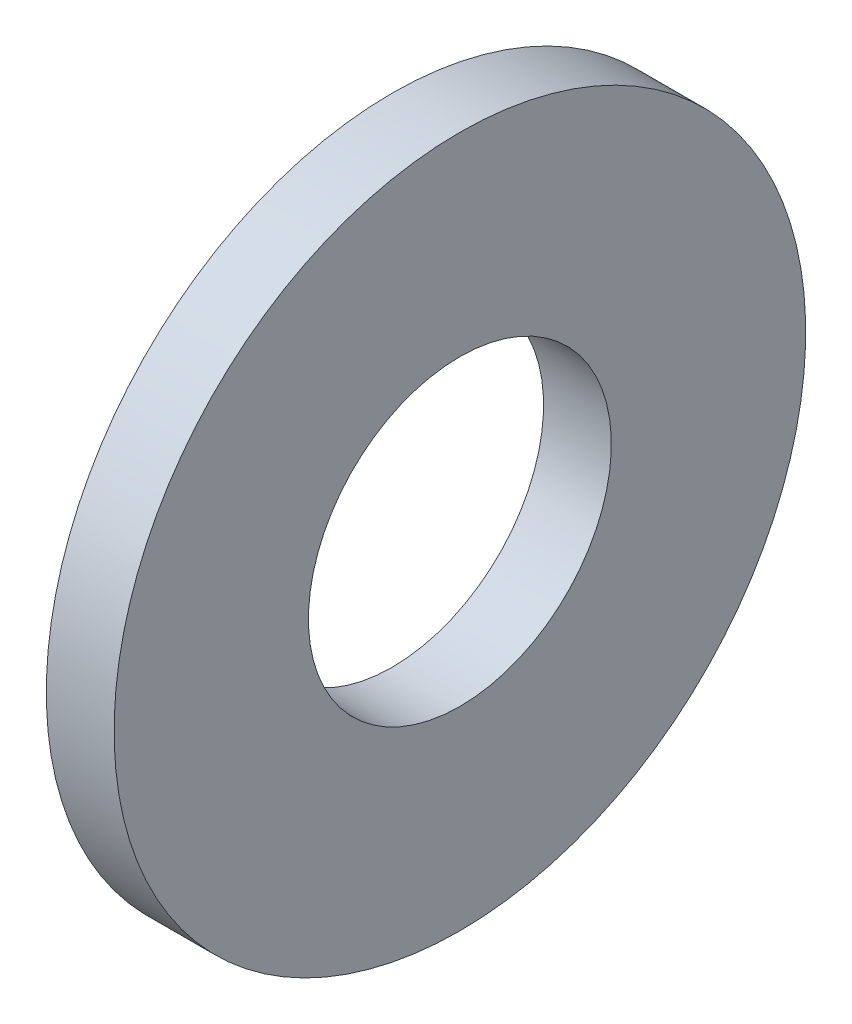
ISO-10303-21;
HEADER;
FILE_DESCRIPTION(('STEP AP214'),'2;1');
FILE_NAME('part.step','',(''),(''),'','','');
FILE_SCHEMA(('AUTOMOTIVE_DESIGN { 1 0 10303 214 1 1 1 1 }'));
ENDSEC;
DATA;
#1=APPLICATION_CONTEXT('core data for automotive mechanical design processes');
#2=APPLICATION_PROTOCOL_DEFINITION('international standard','automotive_design',2000,#1);
#3=PRODUCT_CONTEXT('',#1,'mechanical');
#4=PRODUCT('Part','Part','',(#3));
#5=PRODUCT_RELATED_PRODUCT_CATEGORY('part','',(#4));
#6=PRODUCT_DEFINITION_FORMATION('','',#4);
#7=PRODUCT_DEFINITION_CONTEXT('part definition',#1,'design');
#8=PRODUCT_DEFINITION('design','',#6,#7);
#9=PRODUCT_DEFINITION_SHAPE('','',#8);
#10=(LENGTH_UNIT() NAMED_UNIT(*) SI_UNIT(.MILLI.,.METRE.));
#11=(NAMED_UNIT(*) PLANE_ANGLE_UNIT() SI_UNIT($,.RADIAN.));
#12=(NAMED_UNIT(*) SI_UNIT($,.STERADIAN.) SOLID_ANGLE_UNIT());
#13=UNCERTAINTY_MEASURE_WITH_UNIT(LENGTH_MEASURE(1.E-05),#10,'distance_accuracy_value','');
#14=(GEOMETRIC_REPRESENTATION_CONTEXT(3) GLOBAL_UNCERTAINTY_ASSIGNED_CONTEXT((#13)) GLOBAL_UNIT_ASSIGNED_CONTEXT((#10,
#11,#12)) REPRESENTATION_CONTEXT('',''));
#15=CARTESIAN_POINT('',(0.,0.,0.));
#16=DIRECTION('',(0.,0.,1.));
#17=DIRECTION('',(1.,0.,0.));
#18=AXIS2_PLACEMENT_3D('',#15,#16,#17);
#19=CARTESIAN_POINT('',(0.,2.78129999999999,0.));
#20=DIRECTION('',(-1.,0.,0.));
#21=DIRECTION('',(0.,-1.,0.));
#22=AXIS2_PLACEMENT_3D('',#19,#20,#21);
#23=PLANE('',#22);
#24=CARTESIAN_POINT('',(0.,0.,0.));
#25=DIRECTION('',(-1.,0.,0.));
#26=DIRECTION('',(0.,-1.,0.));
#27=AXIS2_PLACEMENT_3D('',#24,#25,#26);
#28=CIRCLE('',#27,2.7813);
#29=CARTESIAN_POINT('',(0.,-2.78130000000002,0.));
#30=VERTEX_POINT('',#29);
#31=EDGE_CURVE('E17',#30,#30,#28,.T.);
#32=ORIENTED_EDGE('',*,*,#31,.T.);
#33=EDGE_LOOP('',(#32));
#34=FACE_BOUND('',#33,.T.);
#35=CARTESIAN_POINT('',(0.,0.,0.));
#36=DIRECTION('',(-1.,0.,0.));
#37=DIRECTION('',(0.,-1.,0.));
#38=AXIS2_PLACEMENT_3D('',#35,#36,#37);
#39=CIRCLE('',#38,6.35);
#40=CARTESIAN_POINT('',(0.,-6.35000000000002,0.));
#41=VERTEX_POINT('',#40);
#42=EDGE_CURVE('E26',#41,#41,#39,.T.);
#43=ORIENTED_EDGE('',*,*,#42,.F.);
#44=EDGE_LOOP('',(#43));
#45=FACE_BOUND('',#44,.T.);
#46=ADVANCED_FACE('F14',(#34,#45),#23,.F.);
#47=CARTESIAN_POINT('',(-34.9249999999999,0.,0.));
#48=DIRECTION('',(-1.,0.,0.));
#49=DIRECTION('',(0.,-1.,0.));
#50=AXIS2_PLACEMENT_3D('',#47,#48,#49);
#51=CYLINDRICAL_SURFACE('',#50,2.7813);
#52=ORIENTED_EDGE('',*,*,#31,.F.);
#53=EDGE_LOOP('',(#52));
#54=FACE_BOUND('',#53,.T.);
#55=CARTESIAN_POINT('',(-1.24459999999996,0.,0.));
#56=DIRECTION('',(-1.,0.,0.));
#57=DIRECTION('',(0.,-1.,0.));
#58=AXIS2_PLACEMENT_3D('',#55,#56,#57);
#59=CIRCLE('',#58,2.7813);
#60=CARTESIAN_POINT('',(-1.24459999999995,-2.78130000000003,0.));
#61=VERTEX_POINT('',#60);
#62=EDGE_CURVE('E21',#61,#61,#59,.T.);
#63=ORIENTED_EDGE('',*,*,#62,.T.);
#64=EDGE_LOOP('',(#63));
#65=FACE_BOUND('',#64,.T.);
#66=ADVANCED_FACE('F36',(#54,#65),#51,.F.);
#67=CARTESIAN_POINT('',(-34.9249999999999,0.,0.));
#68=DIRECTION('',(-1.,0.,0.));
#69=DIRECTION('',(0.,-1.,0.));
#70=AXIS2_PLACEMENT_3D('',#67,#68,#69);
#71=CYLINDRICAL_SURFACE('',#70,6.35);
#72=CARTESIAN_POINT('',(-1.24459999999996,0.,0.));
#73=DIRECTION('',(-1.,0.,0.));
#74=DIRECTION('',(0.,-1.,0.));
#75=AXIS2_PLACEMENT_3D('',#72,#73,#74);
#76=CIRCLE('',#75,6.35);
#77=CARTESIAN_POINT('',(-1.24459999999996,-6.35000000000003,0.));
#78=VERTEX_POINT('',#77);
#79=EDGE_CURVE('E10',#78,#78,#76,.F.);
#80=ORIENTED_EDGE('',*,*,#79,.T.);
#81=EDGE_LOOP('',(#80));
#82=FACE_BOUND('',#81,.T.);
#83=ORIENTED_EDGE('',*,*,#42,.T.);
#84=EDGE_LOOP('',(#83));
#85=FACE_BOUND('',#84,.T.);
#86=ADVANCED_FACE('F39',(#82,#85),#71,.T.);
#87=CARTESIAN_POINT('',(-1.24459999999993,6.34999999999997,0.));
#88=DIRECTION('',(1.,0.,0.));
#89=DIRECTION('',(0.,1.,0.));
#90=AXIS2_PLACEMENT_3D('',#87,#88,#89);
#91=PLANE('',#90);
#92=ORIENTED_EDGE('',*,*,#79,.F.);
#93=EDGE_LOOP('',(#92));
#94=FACE_BOUND('',#93,.T.);
#95=ORIENTED_EDGE('',*,*,#62,.F.);
#96=EDGE_LOOP('',(#95));
#97=FACE_BOUND('',#96,.T.);
#98=ADVANCED_FACE('F42',(#94,#97),#91,.F.);
#99=CLOSED_SHELL('',(#46,#66,#86,#98));
#100=MANIFOLD_SOLID_BREP('B1',#99);
#101=ADVANCED_BREP_SHAPE_REPRESENTATION('',(#18,#100),#14);
#102=SHAPE_DEFINITION_REPRESENTATION(#9,#101);
ENDSEC;
END-ISO-10303-21;
